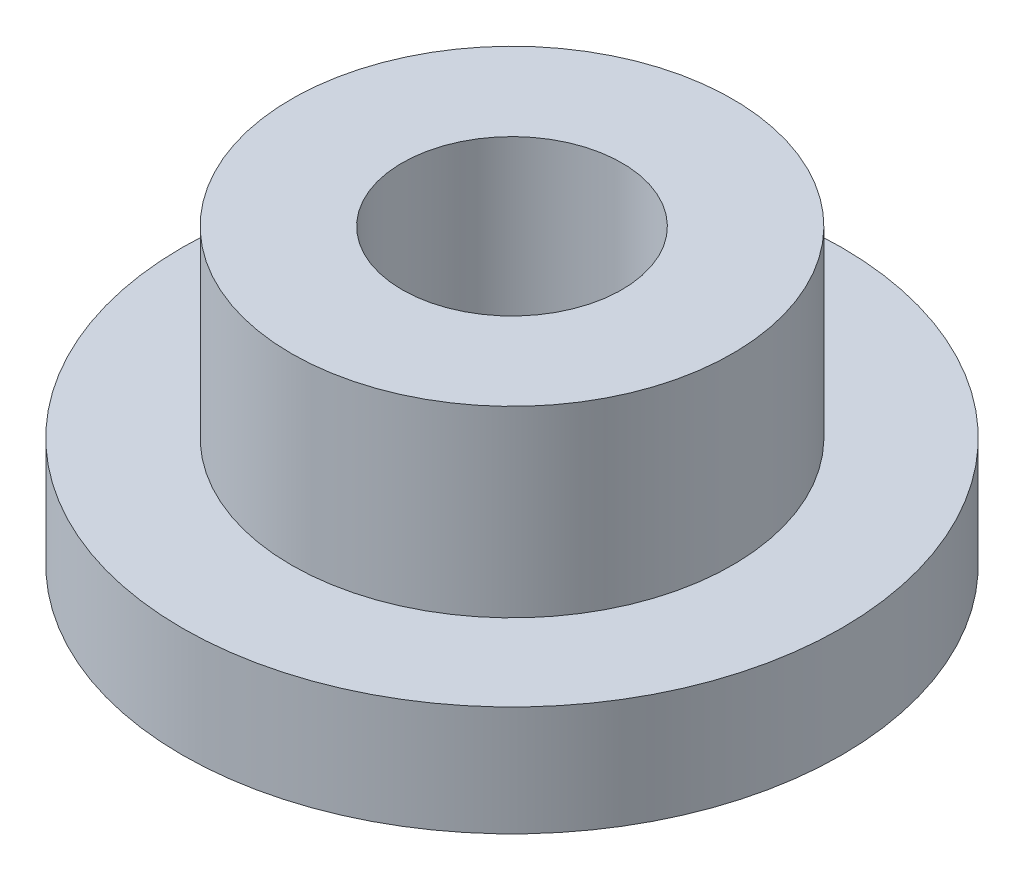
ISO-10303-21;
HEADER;
FILE_DESCRIPTION(('STEP AP214'),'2;1');
FILE_NAME('part.step','',(''),(''),'','','');
FILE_SCHEMA(('AUTOMOTIVE_DESIGN { 1 0 10303 214 1 1 1 1 }'));
ENDSEC;
DATA;
#1=APPLICATION_CONTEXT('core data for automotive mechanical design processes');
#2=APPLICATION_PROTOCOL_DEFINITION('international standard','automotive_design',2000,#1);
#3=PRODUCT_CONTEXT('',#1,'mechanical');
#4=PRODUCT('Part','Part','',(#3));
#5=PRODUCT_RELATED_PRODUCT_CATEGORY('part','',(#4));
#6=PRODUCT_DEFINITION_FORMATION('','',#4);
#7=PRODUCT_DEFINITION_CONTEXT('part definition',#1,'design');
#8=PRODUCT_DEFINITION('design','',#6,#7);
#9=PRODUCT_DEFINITION_SHAPE('','',#8);
#10=(LENGTH_UNIT() NAMED_UNIT(*) SI_UNIT(.MILLI.,.METRE.));
#11=(NAMED_UNIT(*) PLANE_ANGLE_UNIT() SI_UNIT($,.RADIAN.));
#12=(NAMED_UNIT(*) SI_UNIT($,.STERADIAN.) SOLID_ANGLE_UNIT());
#13=UNCERTAINTY_MEASURE_WITH_UNIT(LENGTH_MEASURE(1.E-05),#10,'distance_accuracy_value','');
#14=(GEOMETRIC_REPRESENTATION_CONTEXT(3) GLOBAL_UNCERTAINTY_ASSIGNED_CONTEXT((#13)) GLOBAL_UNIT_ASSIGNED_CONTEXT((#10,
#11,#12)) REPRESENTATION_CONTEXT('',''));
#15=CARTESIAN_POINT('',(0.,0.,0.));
#16=DIRECTION('',(0.,0.,1.));
#17=DIRECTION('',(1.,0.,0.));
#18=AXIS2_PLACEMENT_3D('',#15,#16,#17);
#19=CARTESIAN_POINT('',(0.,4.,0.));
#20=DIRECTION('',(0.,1.,0.));
#21=DIRECTION('',(0.,0.,1.));
#22=AXIS2_PLACEMENT_3D('',#19,#20,#21);
#23=PLANE('',#22);
#24=CARTESIAN_POINT('',(0.,4.,0.));
#25=DIRECTION('',(0.,1.,0.));
#26=DIRECTION('',(0.,0.,1.));
#27=AXIS2_PLACEMENT_3D('',#24,#25,#26);
#28=CIRCLE('',#27,3.01);
#29=CARTESIAN_POINT('',(0.,4.,3.01));
#30=VERTEX_POINT('',#29);
#31=EDGE_CURVE('E10',#30,#30,#28,.T.);
#32=ORIENTED_EDGE('',*,*,#31,.T.);
#33=EDGE_LOOP('',(#32));
#34=FACE_BOUND('',#33,.T.);
#35=CARTESIAN_POINT('',(0.,4.,0.));
#36=DIRECTION('',(0.,1.,0.));
#37=DIRECTION('',(0.,0.,1.));
#38=AXIS2_PLACEMENT_3D('',#35,#36,#37);
#39=CIRCLE('',#38,1.5);
#40=CARTESIAN_POINT('',(0.,4.,1.5));
#41=VERTEX_POINT('',#40);
#42=EDGE_CURVE('E37',#41,#41,#39,.T.);
#43=ORIENTED_EDGE('',*,*,#42,.F.);
#44=EDGE_LOOP('',(#43));
#45=FACE_BOUND('',#44,.T.);
#46=ADVANCED_FACE('F30',(#34,#45),#23,.T.);
#47=CARTESIAN_POINT('',(0.,0.,0.));
#48=DIRECTION('',(0.,1.,0.));
#49=DIRECTION('',(0.,0.,1.));
#50=AXIS2_PLACEMENT_3D('',#47,#48,#49);
#51=PLANE('',#50);
#52=CARTESIAN_POINT('',(0.,0.,0.));
#53=DIRECTION('',(0.,1.,0.));
#54=DIRECTION('',(0.,0.,1.));
#55=AXIS2_PLACEMENT_3D('',#52,#53,#54);
#56=CIRCLE('',#55,1.5);
#57=CARTESIAN_POINT('',(0.,0.,1.5));
#58=VERTEX_POINT('',#57);
#59=EDGE_CURVE('E41',#58,#58,#56,.T.);
#60=ORIENTED_EDGE('',*,*,#59,.T.);
#61=EDGE_LOOP('',(#60));
#62=FACE_BOUND('',#61,.T.);
#63=CARTESIAN_POINT('',(0.,0.,0.));
#64=DIRECTION('',(0.,1.,0.));
#65=DIRECTION('',(0.,0.,1.));
#66=AXIS2_PLACEMENT_3D('',#63,#64,#65);
#67=CIRCLE('',#66,4.5);
#68=CARTESIAN_POINT('',(0.,0.,4.5));
#69=VERTEX_POINT('',#68);
#70=EDGE_CURVE('E48',#69,#69,#67,.T.);
#71=ORIENTED_EDGE('',*,*,#70,.F.);
#72=EDGE_LOOP('',(#71));
#73=FACE_BOUND('',#72,.T.);
#74=ADVANCED_FACE('F73',(#62,#73),#51,.F.);
#75=CARTESIAN_POINT('',(0.,4.,0.));
#76=DIRECTION('',(0.,-1.,0.));
#77=DIRECTION('',(0.,0.,-1.));
#78=AXIS2_PLACEMENT_3D('',#75,#76,#77);
#79=CYLINDRICAL_SURFACE('',#78,3.01);
#80=CARTESIAN_POINT('',(0.,1.5,0.));
#81=DIRECTION('',(0.,1.,0.));
#82=DIRECTION('',(0.,0.,1.));
#83=AXIS2_PLACEMENT_3D('',#80,#81,#82);
#84=CIRCLE('',#83,3.01);
#85=CARTESIAN_POINT('',(0.,1.5,3.01));
#86=VERTEX_POINT('',#85);
#87=EDGE_CURVE('E51',#86,#86,#84,.T.);
#88=ORIENTED_EDGE('',*,*,#87,.T.);
#89=EDGE_LOOP('',(#88));
#90=FACE_BOUND('',#89,.T.);
#91=ORIENTED_EDGE('',*,*,#31,.F.);
#92=EDGE_LOOP('',(#91));
#93=FACE_BOUND('',#92,.T.);
#94=ADVANCED_FACE('F32',(#90,#93),#79,.T.);
#95=CARTESIAN_POINT('',(0.,4.,0.));
#96=DIRECTION('',(0.,-1.,0.));
#97=DIRECTION('',(0.,0.,-1.));
#98=AXIS2_PLACEMENT_3D('',#95,#96,#97);
#99=CYLINDRICAL_SURFACE('',#98,1.5);
#100=ORIENTED_EDGE('',*,*,#42,.T.);
#101=EDGE_LOOP('',(#100));
#102=FACE_BOUND('',#101,.T.);
#103=ORIENTED_EDGE('',*,*,#59,.F.);
#104=EDGE_LOOP('',(#103));
#105=FACE_BOUND('',#104,.T.);
#106=ADVANCED_FACE('F62',(#102,#105),#99,.F.);
#107=CARTESIAN_POINT('',(0.,1.5,0.));
#108=DIRECTION('',(0.,1.,0.));
#109=DIRECTION('',(0.,0.,1.));
#110=AXIS2_PLACEMENT_3D('',#107,#108,#109);
#111=PLANE('',#110);
#112=CARTESIAN_POINT('',(0.,1.5,0.));
#113=DIRECTION('',(0.,1.,0.));
#114=DIRECTION('',(0.,0.,1.));
#115=AXIS2_PLACEMENT_3D('',#112,#113,#114);
#116=CIRCLE('',#115,4.5);
#117=CARTESIAN_POINT('',(0.,1.5,4.5));
#118=VERTEX_POINT('',#117);
#119=EDGE_CURVE('E46',#118,#118,#116,.T.);
#120=ORIENTED_EDGE('',*,*,#119,.T.);
#121=EDGE_LOOP('',(#120));
#122=FACE_BOUND('',#121,.T.);
#123=ORIENTED_EDGE('',*,*,#87,.F.);
#124=EDGE_LOOP('',(#123));
#125=FACE_BOUND('',#124,.T.);
#126=ADVANCED_FACE('F59',(#122,#125),#111,.T.);
#127=CARTESIAN_POINT('',(0.,1.5,0.));
#128=DIRECTION('',(0.,-1.,0.));
#129=DIRECTION('',(0.,0.,-1.));
#130=AXIS2_PLACEMENT_3D('',#127,#128,#129);
#131=CYLINDRICAL_SURFACE('',#130,4.5);
#132=ORIENTED_EDGE('',*,*,#119,.F.);
#133=EDGE_LOOP('',(#132));
#134=FACE_BOUND('',#133,.T.);
#135=ORIENTED_EDGE('',*,*,#70,.T.);
#136=EDGE_LOOP('',(#135));
#137=FACE_BOUND('',#136,.T.);
#138=ADVANCED_FACE('F61',(#134,#137),#131,.T.);
#139=CLOSED_SHELL('',(#46,#74,#94,#106,#126,#138));
#140=MANIFOLD_SOLID_BREP('B2',#139);
#141=ADVANCED_BREP_SHAPE_REPRESENTATION('',(#18,#140),#14);
#142=SHAPE_DEFINITION_REPRESENTATION(#9,#141);
ENDSEC;
END-ISO-10303-21;
